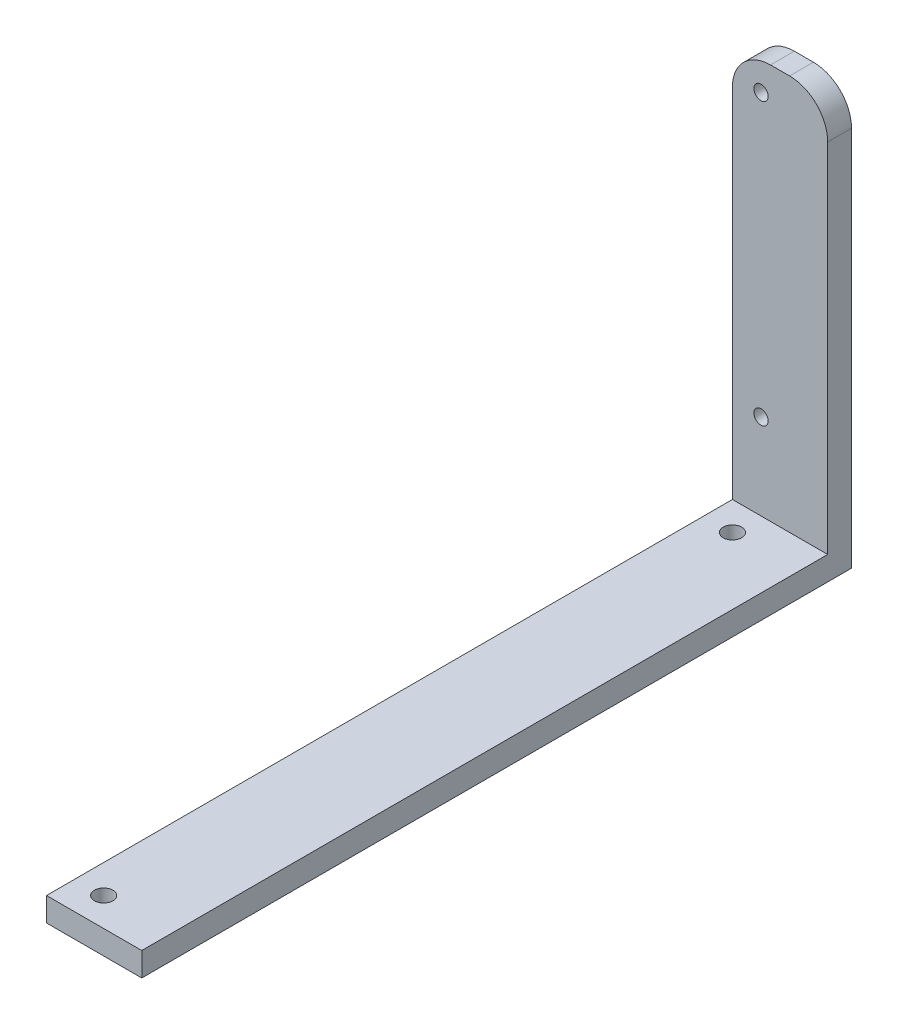
ISO-10303-21;
HEADER;
FILE_DESCRIPTION(('STEP AP214'),'2;1');
FILE_NAME('part.step','',(''),(''),'','','');
FILE_SCHEMA(('AUTOMOTIVE_DESIGN { 1 0 10303 214 1 1 1 1 }'));
ENDSEC;
DATA;
#1=APPLICATION_CONTEXT('core data for automotive mechanical design processes');
#2=APPLICATION_PROTOCOL_DEFINITION('international standard','automotive_design',2000,#1);
#3=PRODUCT_CONTEXT('',#1,'mechanical');
#4=PRODUCT('Part','Part','',(#3));
#5=PRODUCT_RELATED_PRODUCT_CATEGORY('part','',(#4));
#6=PRODUCT_DEFINITION_FORMATION('','',#4);
#7=PRODUCT_DEFINITION_CONTEXT('part definition',#1,'design');
#8=PRODUCT_DEFINITION('design','',#6,#7);
#9=PRODUCT_DEFINITION_SHAPE('','',#8);
#10=(LENGTH_UNIT() NAMED_UNIT(*) SI_UNIT(.MILLI.,.METRE.));
#11=(NAMED_UNIT(*) PLANE_ANGLE_UNIT() SI_UNIT($,.RADIAN.));
#12=(NAMED_UNIT(*) SI_UNIT($,.STERADIAN.) SOLID_ANGLE_UNIT());
#13=UNCERTAINTY_MEASURE_WITH_UNIT(LENGTH_MEASURE(1.E-05),#10,'distance_accuracy_value','');
#14=(GEOMETRIC_REPRESENTATION_CONTEXT(3) GLOBAL_UNCERTAINTY_ASSIGNED_CONTEXT((#13)) GLOBAL_UNIT_ASSIGNED_CONTEXT((#10,
#11,#12)) REPRESENTATION_CONTEXT('',''));
#15=CARTESIAN_POINT('',(0.,0.,0.));
#16=DIRECTION('',(0.,0.,1.));
#17=DIRECTION('',(1.,0.,0.));
#18=AXIS2_PLACEMENT_3D('',#15,#16,#17);
#19=CARTESIAN_POINT('',(0.,0.,5.));
#20=DIRECTION('',(0.,0.,-1.));
#21=DIRECTION('',(-1.,0.,0.));
#22=AXIS2_PLACEMENT_3D('',#19,#20,#21);
#23=PLANE('',#22);
#24=CARTESIAN_POINT('',(6.,23.,5.));
#25=DIRECTION('',(0.,0.,1.));
#26=DIRECTION('',(1.,0.,0.));
#27=AXIS2_PLACEMENT_3D('',#24,#25,#26);
#28=CIRCLE('',#27,1.5);
#29=CARTESIAN_POINT('',(7.5,23.,5.));
#30=VERTEX_POINT('',#29);
#31=EDGE_CURVE('E140',#30,#30,#28,.T.);
#32=ORIENTED_EDGE('',*,*,#31,.F.);
#33=EDGE_LOOP('',(#32));
#34=FACE_BOUND('',#33,.T.);
#35=CARTESIAN_POINT('',(6.,82.,5.));
#36=DIRECTION('',(0.,0.,1.));
#37=DIRECTION('',(1.,0.,0.));
#38=AXIS2_PLACEMENT_3D('',#35,#36,#37);
#39=CIRCLE('',#38,1.5);
#40=CARTESIAN_POINT('',(7.5,82.,5.));
#41=VERTEX_POINT('',#40);
#42=EDGE_CURVE('E178',#41,#41,#39,.T.);
#43=ORIENTED_EDGE('',*,*,#42,.F.);
#44=EDGE_LOOP('',(#43));
#45=FACE_BOUND('',#44,.T.);
#46=DIRECTION('',(0.,1.,0.));
#47=VECTOR('',#46,1.);
#48=CARTESIAN_POINT('',(20.,0.,5.));
#49=LINE('',#48,#47);
#50=CARTESIAN_POINT('',(20.,5.,5.));
#51=VERTEX_POINT('',#50);
#52=CARTESIAN_POINT('',(20.,80.,5.));
#53=VERTEX_POINT('',#52);
#54=EDGE_CURVE('E144',#51,#53,#49,.T.);
#55=ORIENTED_EDGE('',*,*,#54,.T.);
#56=CARTESIAN_POINT('',(12.,80.,5.));
#57=DIRECTION('',(0.,0.,-1.));
#58=DIRECTION('',(-1.,0.,0.));
#59=AXIS2_PLACEMENT_3D('',#56,#57,#58);
#60=CIRCLE('',#59,8.);
#61=CARTESIAN_POINT('',(12.,88.,5.));
#62=VERTEX_POINT('',#61);
#63=EDGE_CURVE('E41',#53,#62,#60,.F.);
#64=ORIENTED_EDGE('',*,*,#63,.T.);
#65=DIRECTION('',(-1.,0.,0.));
#66=VECTOR('',#65,1.);
#67=CARTESIAN_POINT('',(0.,88.,5.));
#68=LINE('',#67,#66);
#69=CARTESIAN_POINT('',(8.,88.,5.));
#70=VERTEX_POINT('',#69);
#71=EDGE_CURVE('E174',#62,#70,#68,.T.);
#72=ORIENTED_EDGE('',*,*,#71,.T.);
#73=CARTESIAN_POINT('',(8.,80.,5.));
#74=DIRECTION('',(0.,0.,-1.));
#75=DIRECTION('',(-1.,0.,0.));
#76=AXIS2_PLACEMENT_3D('',#73,#74,#75);
#77=CIRCLE('',#76,8.);
#78=CARTESIAN_POINT('',(0.,80.,5.));
#79=VERTEX_POINT('',#78);
#80=EDGE_CURVE('E48',#70,#79,#77,.F.);
#81=ORIENTED_EDGE('',*,*,#80,.T.);
#82=DIRECTION('',(0.,-1.,0.));
#83=VECTOR('',#82,1.);
#84=CARTESIAN_POINT('',(0.,0.,5.));
#85=LINE('',#84,#83);
#86=CARTESIAN_POINT('',(0.,5.,5.));
#87=VERTEX_POINT('',#86);
#88=EDGE_CURVE('E164',#79,#87,#85,.T.);
#89=ORIENTED_EDGE('',*,*,#88,.T.);
#90=DIRECTION('',(-1.,0.,0.));
#91=VECTOR('',#90,1.);
#92=CARTESIAN_POINT('',(0.,5.,5.));
#93=LINE('',#92,#91);
#94=EDGE_CURVE('E126',#51,#87,#93,.T.);
#95=ORIENTED_EDGE('',*,*,#94,.F.);
#96=EDGE_LOOP('',(#55,#64,#72,#81,#89,#95));
#97=FACE_BOUND('',#96,.T.);
#98=ADVANCED_FACE('F33',(#34,#45,#97),#23,.F.);
#99=CARTESIAN_POINT('',(0.,0.,0.));
#100=DIRECTION('',(0.,0.,-1.));
#101=DIRECTION('',(-1.,0.,0.));
#102=AXIS2_PLACEMENT_3D('',#99,#100,#101);
#103=PLANE('',#102);
#104=CARTESIAN_POINT('',(6.,82.,0.));
#105=DIRECTION('',(0.,0.,1.));
#106=DIRECTION('',(1.,0.,0.));
#107=AXIS2_PLACEMENT_3D('',#104,#105,#106);
#108=CIRCLE('',#107,1.5);
#109=CARTESIAN_POINT('',(7.5,82.,0.));
#110=VERTEX_POINT('',#109);
#111=EDGE_CURVE('E170',#110,#110,#108,.T.);
#112=ORIENTED_EDGE('',*,*,#111,.T.);
#113=EDGE_LOOP('',(#112));
#114=FACE_BOUND('',#113,.T.);
#115=DIRECTION('',(-1.,0.,0.));
#116=VECTOR('',#115,1.);
#117=CARTESIAN_POINT('',(0.,88.,0.));
#118=LINE('',#117,#116);
#119=CARTESIAN_POINT('',(12.,88.,0.));
#120=VERTEX_POINT('',#119);
#121=CARTESIAN_POINT('',(8.,88.,0.));
#122=VERTEX_POINT('',#121);
#123=EDGE_CURVE('E167',#120,#122,#118,.T.);
#124=ORIENTED_EDGE('',*,*,#123,.F.);
#125=CARTESIAN_POINT('',(12.,80.,0.));
#126=DIRECTION('',(0.,0.,-1.));
#127=DIRECTION('',(-1.,0.,0.));
#128=AXIS2_PLACEMENT_3D('',#125,#126,#127);
#129=CIRCLE('',#128,8.);
#130=CARTESIAN_POINT('',(20.,80.,0.));
#131=VERTEX_POINT('',#130);
#132=EDGE_CURVE('E161',#120,#131,#129,.T.);
#133=ORIENTED_EDGE('',*,*,#132,.T.);
#134=DIRECTION('',(0.,1.,0.));
#135=VECTOR('',#134,1.);
#136=CARTESIAN_POINT('',(20.,0.,0.));
#137=LINE('',#136,#135);
#138=CARTESIAN_POINT('',(20.,0.,0.));
#139=VERTEX_POINT('',#138);
#140=EDGE_CURVE('E180',#139,#131,#137,.T.);
#141=ORIENTED_EDGE('',*,*,#140,.F.);
#142=DIRECTION('',(1.,0.,0.));
#143=VECTOR('',#142,1.);
#144=CARTESIAN_POINT('',(0.,0.,0.));
#145=LINE('',#144,#143);
#146=CARTESIAN_POINT('',(0.,0.,0.));
#147=VERTEX_POINT('',#146);
#148=EDGE_CURVE('E177',#147,#139,#145,.T.);
#149=ORIENTED_EDGE('',*,*,#148,.F.);
#150=DIRECTION('',(0.,-1.,0.));
#151=VECTOR('',#150,1.);
#152=CARTESIAN_POINT('',(0.,0.,0.));
#153=LINE('',#152,#151);
#154=CARTESIAN_POINT('',(0.,80.,0.));
#155=VERTEX_POINT('',#154);
#156=EDGE_CURVE('E108',#155,#147,#153,.T.);
#157=ORIENTED_EDGE('',*,*,#156,.F.);
#158=CARTESIAN_POINT('',(8.,80.,0.));
#159=DIRECTION('',(0.,0.,-1.));
#160=DIRECTION('',(-1.,0.,0.));
#161=AXIS2_PLACEMENT_3D('',#158,#159,#160);
#162=CIRCLE('',#161,8.);
#163=EDGE_CURVE('E159',#155,#122,#162,.T.);
#164=ORIENTED_EDGE('',*,*,#163,.T.);
#165=EDGE_LOOP('',(#124,#133,#141,#149,#157,#164));
#166=FACE_BOUND('',#165,.T.);
#167=CARTESIAN_POINT('',(6.,23.,0.));
#168=DIRECTION('',(0.,0.,1.));
#169=DIRECTION('',(1.,0.,0.));
#170=AXIS2_PLACEMENT_3D('',#167,#168,#169);
#171=CIRCLE('',#170,1.5);
#172=CARTESIAN_POINT('',(7.5,23.,0.));
#173=VERTEX_POINT('',#172);
#174=EDGE_CURVE('E152',#173,#173,#171,.T.);
#175=ORIENTED_EDGE('',*,*,#174,.T.);
#176=EDGE_LOOP('',(#175));
#177=FACE_BOUND('',#176,.T.);
#178=ADVANCED_FACE('F189',(#114,#166,#177),#103,.T.);
#179=CARTESIAN_POINT('',(0.,0.,5.));
#180=DIRECTION('',(1.,0.,0.));
#181=DIRECTION('',(0.,0.,-1.));
#182=AXIS2_PLACEMENT_3D('',#179,#180,#181);
#183=PLANE('',#182);
#184=ORIENTED_EDGE('',*,*,#88,.F.);
#185=DIRECTION('',(0.,0.,-1.));
#186=VECTOR('',#185,1.);
#187=CARTESIAN_POINT('',(0.,80.,5.));
#188=LINE('',#187,#186);
#189=EDGE_CURVE('E11',#79,#155,#188,.T.);
#190=ORIENTED_EDGE('',*,*,#189,.T.);
#191=ORIENTED_EDGE('',*,*,#156,.T.);
#192=DIRECTION('',(0.,0.,-1.));
#193=VECTOR('',#192,1.);
#194=CARTESIAN_POINT('',(0.,0.,5.));
#195=LINE('',#194,#193);
#196=CARTESIAN_POINT('',(0.,0.,149.));
#197=VERTEX_POINT('',#196);
#198=EDGE_CURVE('E101',#197,#147,#195,.T.);
#199=ORIENTED_EDGE('',*,*,#198,.F.);
#200=DIRECTION('',(0.,-1.,0.));
#201=VECTOR('',#200,1.);
#202=CARTESIAN_POINT('',(0.,0.,149.));
#203=LINE('',#202,#201);
#204=CARTESIAN_POINT('',(0.,5.,149.));
#205=VERTEX_POINT('',#204);
#206=EDGE_CURVE('E106',#205,#197,#203,.T.);
#207=ORIENTED_EDGE('',*,*,#206,.F.);
#208=DIRECTION('',(0.,0.,-1.));
#209=VECTOR('',#208,1.);
#210=CARTESIAN_POINT('',(0.,5.,149.));
#211=LINE('',#210,#209);
#212=EDGE_CURVE('E137',#205,#87,#211,.T.);
#213=ORIENTED_EDGE('',*,*,#212,.T.);
#214=EDGE_LOOP('',(#184,#190,#191,#199,#207,#213));
#215=FACE_BOUND('',#214,.T.);
#216=ADVANCED_FACE('F103',(#215),#183,.F.);
#217=CARTESIAN_POINT('',(0.,0.,5.));
#218=DIRECTION('',(0.,1.,0.));
#219=DIRECTION('',(0.,0.,1.));
#220=AXIS2_PLACEMENT_3D('',#217,#218,#219);
#221=PLANE('',#220);
#222=CARTESIAN_POINT('',(6.,0.,11.));
#223=DIRECTION('',(0.,1.,0.));
#224=DIRECTION('',(0.,0.,1.));
#225=AXIS2_PLACEMENT_3D('',#222,#223,#224);
#226=CIRCLE('',#225,1.9394006982284);
#227=CARTESIAN_POINT('',(6.,0.,12.9394006982284));
#228=VERTEX_POINT('',#227);
#229=EDGE_CURVE('E258',#228,#228,#226,.T.);
#230=ORIENTED_EDGE('',*,*,#229,.T.);
#231=EDGE_LOOP('',(#230));
#232=FACE_BOUND('',#231,.T.);
#233=CARTESIAN_POINT('',(6.,0.,143.));
#234=DIRECTION('',(0.,1.,0.));
#235=DIRECTION('',(0.,0.,1.));
#236=AXIS2_PLACEMENT_3D('',#233,#234,#235);
#237=CIRCLE('',#236,1.9394006982284);
#238=CARTESIAN_POINT('',(6.,0.,144.939400698228));
#239=VERTEX_POINT('',#238);
#240=EDGE_CURVE('E129',#239,#239,#237,.T.);
#241=ORIENTED_EDGE('',*,*,#240,.T.);
#242=EDGE_LOOP('',(#241));
#243=FACE_BOUND('',#242,.T.);
#244=ORIENTED_EDGE('',*,*,#148,.T.);
#245=DIRECTION('',(0.,0.,-1.));
#246=VECTOR('',#245,1.);
#247=CARTESIAN_POINT('',(20.,0.,5.));
#248=LINE('',#247,#246);
#249=CARTESIAN_POINT('',(20.,0.,149.));
#250=VERTEX_POINT('',#249);
#251=EDGE_CURVE('E112',#250,#139,#248,.T.);
#252=ORIENTED_EDGE('',*,*,#251,.F.);
#253=DIRECTION('',(1.,0.,0.));
#254=VECTOR('',#253,1.);
#255=CARTESIAN_POINT('',(0.,0.,149.));
#256=LINE('',#255,#254);
#257=EDGE_CURVE('E115',#197,#250,#256,.T.);
#258=ORIENTED_EDGE('',*,*,#257,.F.);
#259=ORIENTED_EDGE('',*,*,#198,.T.);
#260=EDGE_LOOP('',(#244,#252,#258,#259));
#261=FACE_BOUND('',#260,.T.);
#262=ADVANCED_FACE('F116',(#232,#243,#261),#221,.F.);
#263=CARTESIAN_POINT('',(20.,0.,5.));
#264=DIRECTION('',(-1.,0.,0.));
#265=DIRECTION('',(0.,0.,1.));
#266=AXIS2_PLACEMENT_3D('',#263,#264,#265);
#267=PLANE('',#266);
#268=ORIENTED_EDGE('',*,*,#140,.T.);
#269=DIRECTION('',(0.,0.,-1.));
#270=VECTOR('',#269,1.);
#271=CARTESIAN_POINT('',(20.,80.,5.));
#272=LINE('',#271,#270);
#273=EDGE_CURVE('E56',#131,#53,#272,.F.);
#274=ORIENTED_EDGE('',*,*,#273,.T.);
#275=ORIENTED_EDGE('',*,*,#54,.F.);
#276=DIRECTION('',(0.,0.,-1.));
#277=VECTOR('',#276,1.);
#278=CARTESIAN_POINT('',(20.,5.,149.));
#279=LINE('',#278,#277);
#280=CARTESIAN_POINT('',(20.,5.,149.));
#281=VERTEX_POINT('',#280);
#282=EDGE_CURVE('E147',#281,#51,#279,.T.);
#283=ORIENTED_EDGE('',*,*,#282,.F.);
#284=DIRECTION('',(0.,1.,0.));
#285=VECTOR('',#284,1.);
#286=CARTESIAN_POINT('',(20.,0.,149.));
#287=LINE('',#286,#285);
#288=EDGE_CURVE('E120',#250,#281,#287,.T.);
#289=ORIENTED_EDGE('',*,*,#288,.F.);
#290=ORIENTED_EDGE('',*,*,#251,.T.);
#291=EDGE_LOOP('',(#268,#274,#275,#283,#289,#290));
#292=FACE_BOUND('',#291,.T.);
#293=ADVANCED_FACE('F185',(#292),#267,.F.);
#294=CARTESIAN_POINT('',(0.,88.,5.));
#295=DIRECTION('',(0.,-1.,0.));
#296=DIRECTION('',(0.,0.,-1.));
#297=AXIS2_PLACEMENT_3D('',#294,#295,#296);
#298=PLANE('',#297);
#299=ORIENTED_EDGE('',*,*,#71,.F.);
#300=DIRECTION('',(0.,0.,-1.));
#301=VECTOR('',#300,1.);
#302=CARTESIAN_POINT('',(12.,88.,5.));
#303=LINE('',#302,#301);
#304=EDGE_CURVE('E156',#62,#120,#303,.T.);
#305=ORIENTED_EDGE('',*,*,#304,.T.);
#306=ORIENTED_EDGE('',*,*,#123,.T.);
#307=DIRECTION('',(0.,0.,-1.));
#308=VECTOR('',#307,1.);
#309=CARTESIAN_POINT('',(8.,88.,5.));
#310=LINE('',#309,#308);
#311=EDGE_CURVE('E111',#122,#70,#310,.F.);
#312=ORIENTED_EDGE('',*,*,#311,.T.);
#313=EDGE_LOOP('',(#299,#305,#306,#312));
#314=FACE_BOUND('',#313,.T.);
#315=ADVANCED_FACE('F197',(#314),#298,.F.);
#316=CARTESIAN_POINT('',(6.,82.,5.));
#317=DIRECTION('',(0.,0.,-1.));
#318=DIRECTION('',(-1.,0.,0.));
#319=AXIS2_PLACEMENT_3D('',#316,#317,#318);
#320=CYLINDRICAL_SURFACE('',#319,1.5);
#321=ORIENTED_EDGE('',*,*,#42,.T.);
#322=EDGE_LOOP('',(#321));
#323=FACE_BOUND('',#322,.T.);
#324=ORIENTED_EDGE('',*,*,#111,.F.);
#325=EDGE_LOOP('',(#324));
#326=FACE_BOUND('',#325,.T.);
#327=ADVANCED_FACE('F212',(#323,#326),#320,.F.);
#328=CARTESIAN_POINT('',(6.,23.,5.));
#329=DIRECTION('',(0.,0.,-1.));
#330=DIRECTION('',(-1.,0.,0.));
#331=AXIS2_PLACEMENT_3D('',#328,#329,#330);
#332=CYLINDRICAL_SURFACE('',#331,1.5);
#333=ORIENTED_EDGE('',*,*,#31,.T.);
#334=EDGE_LOOP('',(#333));
#335=FACE_BOUND('',#334,.T.);
#336=ORIENTED_EDGE('',*,*,#174,.F.);
#337=EDGE_LOOP('',(#336));
#338=FACE_BOUND('',#337,.T.);
#339=ADVANCED_FACE('F204',(#335,#338),#332,.F.);
#340=CARTESIAN_POINT('',(0.,5.,149.));
#341=DIRECTION('',(0.,-1.,0.));
#342=DIRECTION('',(0.,0.,-1.));
#343=AXIS2_PLACEMENT_3D('',#340,#341,#342);
#344=PLANE('',#343);
#345=CARTESIAN_POINT('',(6.,5.,11.));
#346=DIRECTION('',(0.,1.,0.));
#347=DIRECTION('',(0.,0.,1.));
#348=AXIS2_PLACEMENT_3D('',#345,#346,#347);
#349=CIRCLE('',#348,1.9394006982284);
#350=CARTESIAN_POINT('',(6.,5.,12.9394006982284));
#351=VERTEX_POINT('',#350);
#352=EDGE_CURVE('E260',#351,#351,#349,.T.);
#353=ORIENTED_EDGE('',*,*,#352,.F.);
#354=EDGE_LOOP('',(#353));
#355=FACE_BOUND('',#354,.T.);
#356=CARTESIAN_POINT('',(6.,5.,143.));
#357=DIRECTION('',(0.,1.,0.));
#358=DIRECTION('',(0.,0.,1.));
#359=AXIS2_PLACEMENT_3D('',#356,#357,#358);
#360=CIRCLE('',#359,1.9394006982284);
#361=CARTESIAN_POINT('',(6.,5.,144.939400698228));
#362=VERTEX_POINT('',#361);
#363=EDGE_CURVE('E132',#362,#362,#360,.T.);
#364=ORIENTED_EDGE('',*,*,#363,.F.);
#365=EDGE_LOOP('',(#364));
#366=FACE_BOUND('',#365,.T.);
#367=ORIENTED_EDGE('',*,*,#94,.T.);
#368=ORIENTED_EDGE('',*,*,#212,.F.);
#369=DIRECTION('',(-1.,0.,0.));
#370=VECTOR('',#369,1.);
#371=CARTESIAN_POINT('',(0.,5.,149.));
#372=LINE('',#371,#370);
#373=EDGE_CURVE('E124',#281,#205,#372,.T.);
#374=ORIENTED_EDGE('',*,*,#373,.F.);
#375=ORIENTED_EDGE('',*,*,#282,.T.);
#376=EDGE_LOOP('',(#367,#368,#374,#375));
#377=FACE_BOUND('',#376,.T.);
#378=ADVANCED_FACE('F202',(#355,#366,#377),#344,.F.);
#379=CARTESIAN_POINT('',(0.,0.,149.));
#380=DIRECTION('',(0.,0.,-1.));
#381=DIRECTION('',(-1.,0.,0.));
#382=AXIS2_PLACEMENT_3D('',#379,#380,#381);
#383=PLANE('',#382);
#384=ORIENTED_EDGE('',*,*,#206,.T.);
#385=ORIENTED_EDGE('',*,*,#257,.T.);
#386=ORIENTED_EDGE('',*,*,#288,.T.);
#387=ORIENTED_EDGE('',*,*,#373,.T.);
#388=EDGE_LOOP('',(#384,#385,#386,#387));
#389=FACE_BOUND('',#388,.T.);
#390=ADVANCED_FACE('F122',(#389),#383,.F.);
#391=CARTESIAN_POINT('',(12.,80.,5.));
#392=DIRECTION('',(0.,0.,-1.));
#393=DIRECTION('',(-1.,0.,0.));
#394=AXIS2_PLACEMENT_3D('',#391,#392,#393);
#395=CYLINDRICAL_SURFACE('',#394,8.);
#396=ORIENTED_EDGE('',*,*,#63,.F.);
#397=ORIENTED_EDGE('',*,*,#273,.F.);
#398=ORIENTED_EDGE('',*,*,#132,.F.);
#399=ORIENTED_EDGE('',*,*,#304,.F.);
#400=EDGE_LOOP('',(#396,#397,#398,#399));
#401=FACE_BOUND('',#400,.T.);
#402=ADVANCED_FACE('F194',(#401),#395,.T.);
#403=CARTESIAN_POINT('',(8.,80.,5.));
#404=DIRECTION('',(0.,0.,-1.));
#405=DIRECTION('',(-1.,0.,0.));
#406=AXIS2_PLACEMENT_3D('',#403,#404,#405);
#407=CYLINDRICAL_SURFACE('',#406,8.);
#408=ORIENTED_EDGE('',*,*,#80,.F.);
#409=ORIENTED_EDGE('',*,*,#311,.F.);
#410=ORIENTED_EDGE('',*,*,#163,.F.);
#411=ORIENTED_EDGE('',*,*,#189,.F.);
#412=EDGE_LOOP('',(#408,#409,#410,#411));
#413=FACE_BOUND('',#412,.T.);
#414=ADVANCED_FACE('F35',(#413),#407,.T.);
#415=CARTESIAN_POINT('',(6.,0.,143.));
#416=DIRECTION('',(0.,1.,0.));
#417=DIRECTION('',(0.,0.,1.));
#418=AXIS2_PLACEMENT_3D('',#415,#416,#417);
#419=CYLINDRICAL_SURFACE('',#418,1.9394006982284);
#420=ORIENTED_EDGE('',*,*,#240,.F.);
#421=EDGE_LOOP('',(#420));
#422=FACE_BOUND('',#421,.T.);
#423=ORIENTED_EDGE('',*,*,#363,.T.);
#424=EDGE_LOOP('',(#423));
#425=FACE_BOUND('',#424,.T.);
#426=ADVANCED_FACE('F241',(#422,#425),#419,.F.);
#427=CARTESIAN_POINT('',(6.,0.,11.));
#428=DIRECTION('',(0.,1.,0.));
#429=DIRECTION('',(0.,0.,1.));
#430=AXIS2_PLACEMENT_3D('',#427,#428,#429);
#431=CYLINDRICAL_SURFACE('',#430,1.9394006982284);
#432=ORIENTED_EDGE('',*,*,#229,.F.);
#433=EDGE_LOOP('',(#432));
#434=FACE_BOUND('',#433,.T.);
#435=ORIENTED_EDGE('',*,*,#352,.T.);
#436=EDGE_LOOP('',(#435));
#437=FACE_BOUND('',#436,.T.);
#438=ADVANCED_FACE('F245',(#434,#437),#431,.F.);
#439=CLOSED_SHELL('',(#98,#178,#216,#262,#293,#315,#327,#339,#378,#390,#402,#414,#426,#438));
#440=MANIFOLD_SOLID_BREP('B2',#439);
#441=ADVANCED_BREP_SHAPE_REPRESENTATION('',(#18,#440),#14);
#442=SHAPE_DEFINITION_REPRESENTATION(#9,#441);
ENDSEC;
END-ISO-10303-21;
